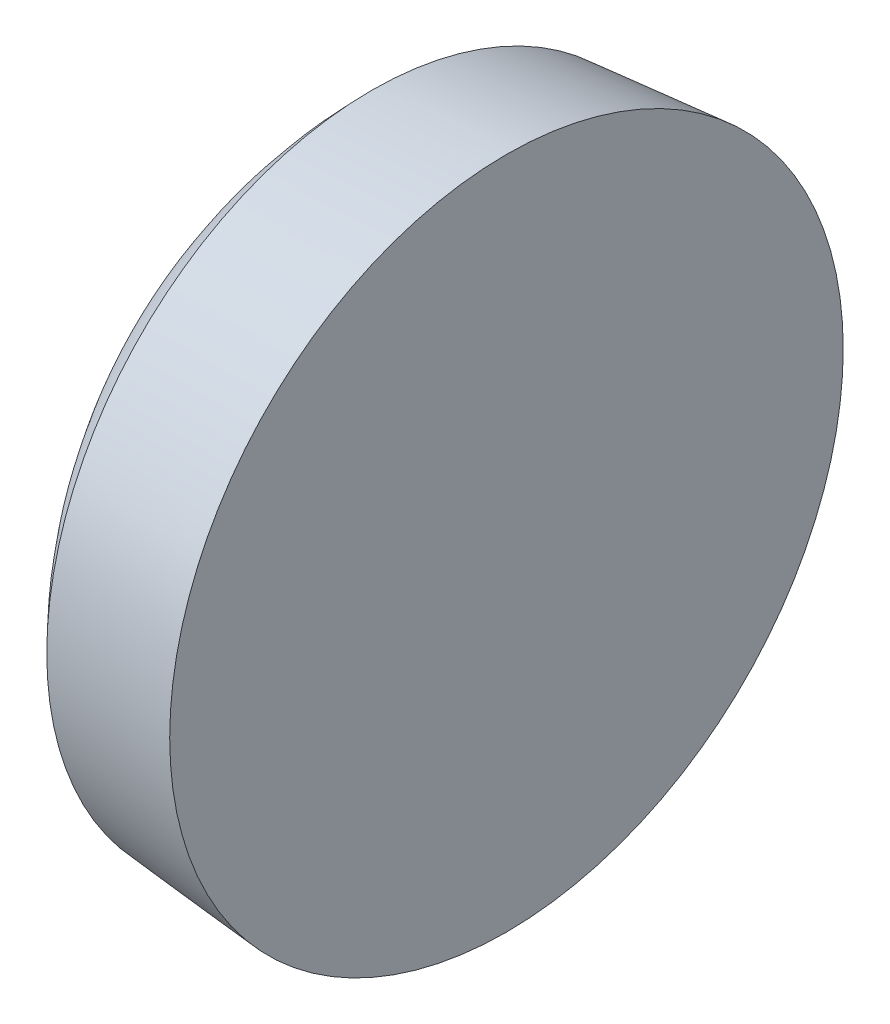
ISO-10303-21;
HEADER;
FILE_DESCRIPTION(('STEP AP214'),'2;1');
FILE_NAME('part.step','',(''),(''),'','','');
FILE_SCHEMA(('AUTOMOTIVE_DESIGN { 1 0 10303 214 1 1 1 1 }'));
ENDSEC;
DATA;
#1=APPLICATION_CONTEXT('core data for automotive mechanical design processes');
#2=APPLICATION_PROTOCOL_DEFINITION('international standard','automotive_design',2000,#1);
#3=PRODUCT_CONTEXT('',#1,'mechanical');
#4=PRODUCT('Part','Part','',(#3));
#5=PRODUCT_RELATED_PRODUCT_CATEGORY('part','',(#4));
#6=PRODUCT_DEFINITION_FORMATION('','',#4);
#7=PRODUCT_DEFINITION_CONTEXT('part definition',#1,'design');
#8=PRODUCT_DEFINITION('design','',#6,#7);
#9=PRODUCT_DEFINITION_SHAPE('','',#8);
#10=(LENGTH_UNIT() NAMED_UNIT(*) SI_UNIT(.MILLI.,.METRE.));
#11=(NAMED_UNIT(*) PLANE_ANGLE_UNIT() SI_UNIT($,.RADIAN.));
#12=(NAMED_UNIT(*) SI_UNIT($,.STERADIAN.) SOLID_ANGLE_UNIT());
#13=UNCERTAINTY_MEASURE_WITH_UNIT(LENGTH_MEASURE(1.E-05),#10,'distance_accuracy_value','');
#14=(GEOMETRIC_REPRESENTATION_CONTEXT(3) GLOBAL_UNCERTAINTY_ASSIGNED_CONTEXT((#13)) GLOBAL_UNIT_ASSIGNED_CONTEXT((#10,
#11,#12)) REPRESENTATION_CONTEXT('',''));
#15=CARTESIAN_POINT('',(0.,0.,0.));
#16=DIRECTION('',(0.,0.,1.));
#17=DIRECTION('',(1.,0.,0.));
#18=AXIS2_PLACEMENT_3D('',#15,#16,#17);
#19=CARTESIAN_POINT('',(176.066666666667,-6.9,10.));
#20=DIRECTION('',(-1.,0.,0.));
#21=DIRECTION('',(0.,0.,1.));
#22=AXIS2_PLACEMENT_3D('',#19,#20,#21);
#23=PLANE('',#22);
#24=DIRECTION('',(0.,0.,-1.));
#25=VECTOR('',#24,1.);
#26=CARTESIAN_POINT('',(176.066666666667,-5.95,10.));
#27=LINE('',#26,#25);
#28=CARTESIAN_POINT('',(176.066666666667,-5.95,9.82));
#29=VERTEX_POINT('',#28);
#30=CARTESIAN_POINT('',(176.066666666667,-5.95,10.18));
#31=VERTEX_POINT('',#30);
#32=EDGE_CURVE('E293',#29,#31,#27,.F.);
#33=ORIENTED_EDGE('',*,*,#32,.F.);
#34=DIRECTION('',(0.,1.,0.));
#35=VECTOR('',#34,1.);
#36=CARTESIAN_POINT('',(176.066666666667,-6.9,9.82));
#37=LINE('',#36,#35);
#38=CARTESIAN_POINT('',(176.066666666667,-6.72,9.82));
#39=VERTEX_POINT('',#38);
#40=EDGE_CURVE('E298',#39,#29,#37,.T.);
#41=ORIENTED_EDGE('',*,*,#40,.F.);
#42=DIRECTION('',(0.,0.,-1.));
#43=VECTOR('',#42,1.);
#44=CARTESIAN_POINT('',(176.066666666667,-6.72,10.));
#45=LINE('',#44,#43);
#46=CARTESIAN_POINT('',(176.066666666667,-6.72,9.05));
#47=VERTEX_POINT('',#46);
#48=EDGE_CURVE('E303',#47,#39,#45,.F.);
#49=ORIENTED_EDGE('',*,*,#48,.F.);
#50=DIRECTION('',(0.,1.,0.));
#51=VECTOR('',#50,1.);
#52=CARTESIAN_POINT('',(176.066666666667,-6.9,9.05));
#53=LINE('',#52,#51);
#54=CARTESIAN_POINT('',(176.066666666667,-7.08,9.05));
#55=VERTEX_POINT('',#54);
#56=EDGE_CURVE('E308',#55,#47,#53,.T.);
#57=ORIENTED_EDGE('',*,*,#56,.F.);
#58=DIRECTION('',(0.,0.,1.));
#59=VECTOR('',#58,1.);
#60=CARTESIAN_POINT('',(176.066666666667,-7.08,10.));
#61=LINE('',#60,#59);
#62=CARTESIAN_POINT('',(176.066666666667,-7.08,9.82));
#63=VERTEX_POINT('',#62);
#64=EDGE_CURVE('E313',#63,#55,#61,.F.);
#65=ORIENTED_EDGE('',*,*,#64,.F.);
#66=DIRECTION('',(0.,1.,0.));
#67=VECTOR('',#66,1.);
#68=CARTESIAN_POINT('',(176.066666666667,-6.9,9.82));
#69=LINE('',#68,#67);
#70=CARTESIAN_POINT('',(176.066666666667,-7.85,9.82));
#71=VERTEX_POINT('',#70);
#72=EDGE_CURVE('E318',#71,#63,#69,.T.);
#73=ORIENTED_EDGE('',*,*,#72,.F.);
#74=DIRECTION('',(0.,0.,-1.));
#75=VECTOR('',#74,1.);
#76=CARTESIAN_POINT('',(176.066666666667,-7.85,10.));
#77=LINE('',#76,#75);
#78=CARTESIAN_POINT('',(176.066666666667,-7.85,10.18));
#79=VERTEX_POINT('',#78);
#80=EDGE_CURVE('E267',#71,#79,#77,.F.);
#81=ORIENTED_EDGE('',*,*,#80,.T.);
#82=DIRECTION('',(0.,1.,0.));
#83=VECTOR('',#82,1.);
#84=CARTESIAN_POINT('',(176.066666666667,-6.9,10.18));
#85=LINE('',#84,#83);
#86=CARTESIAN_POINT('',(176.066666666667,-7.08,10.18));
#87=VERTEX_POINT('',#86);
#88=EDGE_CURVE('E264',#87,#79,#85,.F.);
#89=ORIENTED_EDGE('',*,*,#88,.F.);
#90=DIRECTION('',(0.,0.,1.));
#91=VECTOR('',#90,1.);
#92=CARTESIAN_POINT('',(176.066666666667,-7.08,10.));
#93=LINE('',#92,#91);
#94=CARTESIAN_POINT('',(176.066666666667,-7.08,10.95));
#95=VERTEX_POINT('',#94);
#96=EDGE_CURVE('E260',#95,#87,#93,.F.);
#97=ORIENTED_EDGE('',*,*,#96,.F.);
#98=DIRECTION('',(0.,1.,0.));
#99=VECTOR('',#98,1.);
#100=CARTESIAN_POINT('',(176.066666666667,-6.9,10.95));
#101=LINE('',#100,#99);
#102=CARTESIAN_POINT('',(176.066666666667,-6.72,10.95));
#103=VERTEX_POINT('',#102);
#104=EDGE_CURVE('E231',#95,#103,#101,.T.);
#105=ORIENTED_EDGE('',*,*,#104,.T.);
#106=DIRECTION('',(0.,0.,-1.));
#107=VECTOR('',#106,1.);
#108=CARTESIAN_POINT('',(176.066666666667,-6.72,10.));
#109=LINE('',#108,#107);
#110=CARTESIAN_POINT('',(176.066666666667,-6.72,10.18));
#111=VERTEX_POINT('',#110);
#112=EDGE_CURVE('E278',#111,#103,#109,.F.);
#113=ORIENTED_EDGE('',*,*,#112,.F.);
#114=DIRECTION('',(0.,1.,0.));
#115=VECTOR('',#114,1.);
#116=CARTESIAN_POINT('',(176.066666666667,-6.9,10.18));
#117=LINE('',#116,#115);
#118=EDGE_CURVE('E288',#31,#111,#117,.F.);
#119=ORIENTED_EDGE('',*,*,#118,.F.);
#120=EDGE_LOOP('',(#33,#41,#49,#57,#65,#73,#81,#89,#97,#105,#113,#119));
#121=FACE_BOUND('',#120,.T.);
#122=ADVANCED_FACE('F17',(#121),#23,.T.);
#123=CARTESIAN_POINT('',(175.466666666667,-7.08,10.));
#124=DIRECTION('',(0.,1.,0.));
#125=DIRECTION('',(0.,0.,1.));
#126=AXIS2_PLACEMENT_3D('',#123,#124,#125);
#127=PLANE('',#126);
#128=DIRECTION('',(1.,0.,0.));
#129=VECTOR('',#128,1.);
#130=CARTESIAN_POINT('',(175.466666666667,-7.08,10.95));
#131=LINE('',#130,#129);
#132=CARTESIAN_POINT('',(175.043762143476,-7.08,10.9500000000001));
#133=VERTEX_POINT('',#132);
#134=EDGE_CURVE('E89',#133,#95,#131,.T.);
#135=ORIENTED_EDGE('',*,*,#134,.T.);
#136=ORIENTED_EDGE('',*,*,#96,.T.);
#137=DIRECTION('',(-1.,0.,0.));
#138=VECTOR('',#137,1.);
#139=CARTESIAN_POINT('',(175.466666666667,-7.08,10.18));
#140=LINE('',#139,#138);
#141=CARTESIAN_POINT('',(174.878569096873,-7.08000000000002,10.18));
#142=VERTEX_POINT('',#141);
#143=EDGE_CURVE('E224',#142,#87,#140,.F.);
#144=ORIENTED_EDGE('',*,*,#143,.F.);
#145=CARTESIAN_POINT('',(175.043762143476,-7.08,10.9500000000001));
#146=CARTESIAN_POINT('',(175.032217129282,-7.08,10.9189995540507));
#147=CARTESIAN_POINT('',(175.021237746898,-7.08,10.8877884938069));
#148=CARTESIAN_POINT('',(175.00046454836,-7.08,10.825110453647));
#149=CARTESIAN_POINT('',(174.990666241349,-7.08,10.7936449620742));
#150=CARTESIAN_POINT('',(174.972242700709,-7.08,10.7304618501357));
#151=CARTESIAN_POINT('',(174.96361446108,-7.08,10.6987451062673));
#152=CARTESIAN_POINT('',(174.947522711913,-7.08,10.6350619663156));
#153=CARTESIAN_POINT('',(174.940057683091,-7.08,10.6030959541243));
#154=CARTESIAN_POINT('',(174.926288504705,-7.08,10.5389148788569));
#155=CARTESIAN_POINT('',(174.91998435514,-7.08,10.5066998157809));
#156=CARTESIAN_POINT('',(174.908537607774,-7.08,10.4420201537525));
#157=CARTESIAN_POINT('',(174.903396553029,-7.08,10.4095552817086));
#158=CARTESIAN_POINT('',(174.894281504356,-7.08,10.3443751591894));
#159=CARTESIAN_POINT('',(174.890310611427,-7.08,10.3116594750373));
#160=CARTESIAN_POINT('',(174.883545624518,-7.08,10.2459761632456));
#161=CARTESIAN_POINT('',(174.880756236699,-7.08,10.2130080508538));
#162=CARTESIAN_POINT('',(174.878569096873,-7.08,10.18));
#163=B_SPLINE_CURVE_WITH_KNOTS('',3,(#145,#146,#147,#148,#149,#150,#151,#152,#153,#154,#155,
#156,#157,#158,#159,#160,#161,#162),.UNSPECIFIED.,.F.,.F.,(4,2,2,2,2,2,2,2,4),(0.,
0.0992357442434378,0.198081387639297,0.296668072480536,0.39512489269415,0.493581712907767,
0.592168397749006,0.691014041144867,0.790249785388302),.UNSPECIFIED.);
#164=EDGE_CURVE('E20',#133,#142,#163,.T.);
#165=ORIENTED_EDGE('',*,*,#164,.F.);
#166=EDGE_LOOP('',(#135,#136,#144,#165));
#167=FACE_BOUND('',#166,.T.);
#168=ADVANCED_FACE('F221',(#167),#127,.T.);
#169=CARTESIAN_POINT('',(175.466666666667,-6.9,10.18));
#170=DIRECTION('',(0.,0.,-1.));
#171=DIRECTION('',(-1.,0.,0.));
#172=AXIS2_PLACEMENT_3D('',#169,#170,#171);
#173=PLANE('',#172);
#174=ORIENTED_EDGE('',*,*,#88,.T.);
#175=DIRECTION('',(1.,0.,0.));
#176=VECTOR('',#175,1.);
#177=CARTESIAN_POINT('',(175.466666666667,-7.85,10.18));
#178=LINE('',#177,#176);
#179=CARTESIAN_POINT('',(175.043762143476,-7.85,10.18));
#180=VERTEX_POINT('',#179);
#181=EDGE_CURVE('E324',#79,#180,#178,.F.);
#182=ORIENTED_EDGE('',*,*,#181,.T.);
#183=CARTESIAN_POINT('',(174.878569096873,-7.08000000000003,10.18));
#184=CARTESIAN_POINT('',(174.884223275561,-7.16559008255585,10.18));
#185=CARTESIAN_POINT('',(174.893954762962,-7.25090347737772,10.18));
#186=CARTESIAN_POINT('',(174.921321880478,-7.41965906159773,10.18));
#187=CARTESIAN_POINT('',(174.938903434517,-7.50311001948201,10.18));
#188=CARTESIAN_POINT('',(174.983632564079,-7.67504249159054,10.18));
#189=CARTESIAN_POINT('',(175.011468627175,-7.76334531100356,10.18));
#190=CARTESIAN_POINT('',(175.043762143476,-7.85000000000013,10.18));
#191=B_SPLINE_CURVE_WITH_KNOTS('',3,(#183,#184,#185,#186,#187,#188,#189,#190),.UNSPECIFIED.,.F.,
.F.,(4,2,2,4),(0.,0.257221658829358,0.512698117737389,0.78998348623172),.UNSPECIFIED.);
#192=EDGE_CURVE('E213',#142,#180,#191,.T.);
#193=ORIENTED_EDGE('',*,*,#192,.F.);
#194=ORIENTED_EDGE('',*,*,#143,.T.);
#195=EDGE_LOOP('',(#174,#182,#193,#194));
#196=FACE_BOUND('',#195,.T.);
#197=ADVANCED_FACE('F204',(#196),#173,.T.);
#198=CARTESIAN_POINT('',(175.466666666667,-7.85,10.));
#199=DIRECTION('',(0.,-1.,0.));
#200=DIRECTION('',(0.,0.,-1.));
#201=AXIS2_PLACEMENT_3D('',#198,#199,#200);
#202=PLANE('',#201);
#203=ORIENTED_EDGE('',*,*,#181,.F.);
#204=ORIENTED_EDGE('',*,*,#80,.F.);
#205=DIRECTION('',(1.,0.,0.));
#206=VECTOR('',#205,1.);
#207=CARTESIAN_POINT('',(175.466666666667,-7.85,9.82));
#208=LINE('',#207,#206);
#209=CARTESIAN_POINT('',(175.043762143476,-7.85000000000007,9.82));
#210=VERTEX_POINT('',#209);
#211=EDGE_CURVE('E320',#210,#71,#208,.T.);
#212=ORIENTED_EDGE('',*,*,#211,.F.);
#213=CARTESIAN_POINT('',(175.043762143476,-7.85,10.18));
#214=CARTESIAN_POINT('',(175.039533747777,-7.85000000000002,10.12));
#215=CARTESIAN_POINT('',(175.037419549928,-7.85000000000002,10.06));
#216=CARTESIAN_POINT('',(175.037419549928,-7.84999999999998,9.93999999999995));
#217=CARTESIAN_POINT('',(175.039533747777,-7.84999999999994,9.87999999999993));
#218=CARTESIAN_POINT('',(175.043762143476,-7.84999999999989,9.81999999999991));
#219=B_SPLINE_CURVE_WITH_KNOTS('',3,(#213,#214,#215,#216,#217,#218),.UNSPECIFIED.,.F.,.F.,(4,2,
4),(0.,0.180111711148747,0.360223422297494),.UNSPECIFIED.);
#220=EDGE_CURVE('E207',#180,#210,#219,.T.);
#221=ORIENTED_EDGE('',*,*,#220,.F.);
#222=EDGE_LOOP('',(#203,#204,#212,#221));
#223=FACE_BOUND('',#222,.T.);
#224=ADVANCED_FACE('F199',(#223),#202,.F.);
#225=CARTESIAN_POINT('',(175.466666666667,-6.9,9.82));
#226=DIRECTION('',(0.,0.,1.));
#227=DIRECTION('',(1.,0.,0.));
#228=AXIS2_PLACEMENT_3D('',#225,#226,#227);
#229=PLANE('',#228);
#230=ORIENTED_EDGE('',*,*,#72,.T.);
#231=DIRECTION('',(1.,0.,0.));
#232=VECTOR('',#231,1.);
#233=CARTESIAN_POINT('',(175.466666666667,-7.08,9.82));
#234=LINE('',#233,#232);
#235=CARTESIAN_POINT('',(174.878569096873,-7.08,9.81999999999998));
#236=VERTEX_POINT('',#235);
#237=EDGE_CURVE('E315',#236,#63,#234,.T.);
#238=ORIENTED_EDGE('',*,*,#237,.F.);
#239=CARTESIAN_POINT('',(175.043762143476,-7.85000000000013,9.82));
#240=CARTESIAN_POINT('',(175.032217129282,-7.81899955405071,9.82));
#241=CARTESIAN_POINT('',(175.021237746898,-7.78778849380685,9.82));
#242=CARTESIAN_POINT('',(175.00046454836,-7.72511045364696,9.82));
#243=CARTESIAN_POINT('',(174.990666241349,-7.69364496207416,9.82));
#244=CARTESIAN_POINT('',(174.972242700709,-7.6304618501357,9.82));
#245=CARTESIAN_POINT('',(174.96361446108,-7.59874510626734,9.82));
#246=CARTESIAN_POINT('',(174.947522711913,-7.53506196631559,9.82));
#247=CARTESIAN_POINT('',(174.940057683091,-7.50309595412427,9.82));
#248=CARTESIAN_POINT('',(174.926288504705,-7.43891487885691,9.82));
#249=CARTESIAN_POINT('',(174.91998435514,-7.40669981578087,9.82));
#250=CARTESIAN_POINT('',(174.908537607774,-7.34202015375246,9.82));
#251=CARTESIAN_POINT('',(174.903396553029,-7.30955528170863,9.82));
#252=CARTESIAN_POINT('',(174.894281504356,-7.24437515918937,9.82));
#253=CARTESIAN_POINT('',(174.890310611427,-7.21165947503728,9.82));
#254=CARTESIAN_POINT('',(174.883545624518,-7.14597616324565,9.82));
#255=CARTESIAN_POINT('',(174.880756236699,-7.11300805085382,9.82));
#256=CARTESIAN_POINT('',(174.878569096873,-7.08000000000003,9.82));
#257=B_SPLINE_CURVE_WITH_KNOTS('',3,(#239,#240,#241,#242,#243,#244,#245,#246,#247,#248,#249,
#250,#251,#252,#253,#254,#255,#256),.UNSPECIFIED.,.F.,.F.,(4,2,2,2,2,2,2,2,4),(0.,
0.0992357442434378,0.198081387639298,0.296668072480536,0.39512489269415,0.493581712907767,
0.592168397749009,0.691014041144869,0.790249785388304),.UNSPECIFIED.);
#258=EDGE_CURVE('E184',#210,#236,#257,.T.);
#259=ORIENTED_EDGE('',*,*,#258,.F.);
#260=ORIENTED_EDGE('',*,*,#211,.T.);
#261=EDGE_LOOP('',(#230,#238,#259,#260));
#262=FACE_BOUND('',#261,.T.);
#263=ADVANCED_FACE('F194',(#262),#229,.T.);
#264=CARTESIAN_POINT('',(175.466666666667,-7.08,10.));
#265=DIRECTION('',(0.,1.,0.));
#266=DIRECTION('',(0.,0.,1.));
#267=AXIS2_PLACEMENT_3D('',#264,#265,#266);
#268=PLANE('',#267);
#269=DIRECTION('',(1.,0.,0.));
#270=VECTOR('',#269,1.);
#271=CARTESIAN_POINT('',(175.466666666667,-7.08,9.05));
#272=LINE('',#271,#270);
#273=CARTESIAN_POINT('',(175.043762143476,-7.08,9.05));
#274=VERTEX_POINT('',#273);
#275=EDGE_CURVE('E310',#274,#55,#272,.T.);
#276=ORIENTED_EDGE('',*,*,#275,.F.);
#277=CARTESIAN_POINT('',(174.878569096873,-7.08,9.81999999999997));
#278=CARTESIAN_POINT('',(174.884223275561,-7.08,9.73440991744415));
#279=CARTESIAN_POINT('',(174.893954762962,-7.08,9.64909652262228));
#280=CARTESIAN_POINT('',(174.921321880478,-7.08,9.48034093840227));
#281=CARTESIAN_POINT('',(174.938903434517,-7.08,9.39688998051799));
#282=CARTESIAN_POINT('',(174.983632564079,-7.08,9.22495750840946));
#283=CARTESIAN_POINT('',(175.011468627175,-7.08,9.13665468899644));
#284=CARTESIAN_POINT('',(175.043762143476,-7.08,9.04999999999987));
#285=B_SPLINE_CURVE_WITH_KNOTS('',3,(#277,#278,#279,#280,#281,#282,#283,#284),.UNSPECIFIED.,.F.,
.F.,(4,2,2,4),(0.,0.257221658829358,0.512698117737392,0.789983486231717),.UNSPECIFIED.);
#286=EDGE_CURVE('E176',#236,#274,#285,.T.);
#287=ORIENTED_EDGE('',*,*,#286,.F.);
#288=ORIENTED_EDGE('',*,*,#237,.T.);
#289=ORIENTED_EDGE('',*,*,#64,.T.);
#290=EDGE_LOOP('',(#276,#287,#288,#289));
#291=FACE_BOUND('',#290,.T.);
#292=ADVANCED_FACE('F191',(#291),#268,.T.);
#293=CARTESIAN_POINT('',(175.466666666667,-6.9,9.05));
#294=DIRECTION('',(0.,0.,1.));
#295=DIRECTION('',(1.,0.,0.));
#296=AXIS2_PLACEMENT_3D('',#293,#294,#295);
#297=PLANE('',#296);
#298=DIRECTION('',(1.,0.,0.));
#299=VECTOR('',#298,1.);
#300=CARTESIAN_POINT('',(175.466666666667,-6.72,9.05));
#301=LINE('',#300,#299);
#302=CARTESIAN_POINT('',(175.043762143476,-6.72,9.04999999999994));
#303=VERTEX_POINT('',#302);
#304=EDGE_CURVE('E305',#303,#47,#301,.T.);
#305=ORIENTED_EDGE('',*,*,#304,.F.);
#306=CARTESIAN_POINT('',(175.043762143476,-6.72,9.05));
#307=CARTESIAN_POINT('',(175.037419549928,-6.80988825418797,9.05));
#308=CARTESIAN_POINT('',(175.037419549928,-6.9,9.05));
#309=B_SPLINE_CURVE_WITH_KNOTS('',2,(#306,#307,#308),.UNSPECIFIED.,.F.,.F.,(3,3),(0.,1.),.UNSPECIFIED.);
#310=CARTESIAN_POINT('',(175.037419549928,-6.9,9.05));
#311=VERTEX_POINT('',#310);
#312=EDGE_CURVE('E175',#311,#303,#309,.F.);
#313=ORIENTED_EDGE('',*,*,#312,.F.);
#314=CARTESIAN_POINT('',(175.037419549928,-6.9,9.05));
#315=CARTESIAN_POINT('',(175.037419549928,-6.99011174581202,9.05));
#316=CARTESIAN_POINT('',(175.043762143476,-7.08,9.05));
#317=B_SPLINE_CURVE_WITH_KNOTS('',2,(#314,#315,#316),.UNSPECIFIED.,.F.,.F.,(3,3),(0.,1.),.UNSPECIFIED.);
#318=EDGE_CURVE('E183',#274,#311,#317,.F.);
#319=ORIENTED_EDGE('',*,*,#318,.F.);
#320=ORIENTED_EDGE('',*,*,#275,.T.);
#321=ORIENTED_EDGE('',*,*,#56,.T.);
#322=EDGE_LOOP('',(#305,#313,#319,#320,#321));
#323=FACE_BOUND('',#322,.T.);
#324=ADVANCED_FACE('F164',(#323),#297,.T.);
#325=CARTESIAN_POINT('',(175.466666666667,-6.72,10.));
#326=DIRECTION('',(0.,-1.,0.));
#327=DIRECTION('',(0.,0.,-1.));
#328=AXIS2_PLACEMENT_3D('',#325,#326,#327);
#329=PLANE('',#328);
#330=ORIENTED_EDGE('',*,*,#304,.T.);
#331=ORIENTED_EDGE('',*,*,#48,.T.);
#332=DIRECTION('',(1.,0.,0.));
#333=VECTOR('',#332,1.);
#334=CARTESIAN_POINT('',(175.466666666667,-6.72,9.82));
#335=LINE('',#334,#333);
#336=CARTESIAN_POINT('',(174.878569096873,-6.71999999999999,9.82));
#337=VERTEX_POINT('',#336);
#338=EDGE_CURVE('E300',#337,#39,#335,.T.);
#339=ORIENTED_EDGE('',*,*,#338,.F.);
#340=CARTESIAN_POINT('',(175.043762143476,-6.72,9.04999999999987));
#341=CARTESIAN_POINT('',(175.032217129282,-6.72,9.08100044594929));
#342=CARTESIAN_POINT('',(175.021237746898,-6.72,9.11221150619315));
#343=CARTESIAN_POINT('',(175.00046454836,-6.72,9.17488954635304));
#344=CARTESIAN_POINT('',(174.990666241349,-6.72,9.20635503792584));
#345=CARTESIAN_POINT('',(174.972242700709,-6.72,9.2695381498643));
#346=CARTESIAN_POINT('',(174.96361446108,-6.72,9.30125489373266));
#347=CARTESIAN_POINT('',(174.947522711913,-6.72,9.36493803368441));
#348=CARTESIAN_POINT('',(174.940057683091,-6.72,9.39690404587573));
#349=CARTESIAN_POINT('',(174.926288504705,-6.72,9.46108512114309));
#350=CARTESIAN_POINT('',(174.91998435514,-6.72,9.49330018421913));
#351=CARTESIAN_POINT('',(174.908537607774,-6.72,9.55797984624755));
#352=CARTESIAN_POINT('',(174.903396553029,-6.72,9.59044471829137));
#353=CARTESIAN_POINT('',(174.894281504356,-6.72,9.65562484081063));
#354=CARTESIAN_POINT('',(174.890310611427,-6.72,9.68834052496272));
#355=CARTESIAN_POINT('',(174.883545624518,-6.72,9.75402383675435));
#356=CARTESIAN_POINT('',(174.880756236699,-6.72,9.78699194914618));
#357=CARTESIAN_POINT('',(174.878569096873,-6.72,9.81999999999997));
#358=B_SPLINE_CURVE_WITH_KNOTS('',3,(#340,#341,#342,#343,#344,#345,#346,#347,#348,#349,#350,
#351,#352,#353,#354,#355,#356,#357),.UNSPECIFIED.,.F.,.F.,(4,2,2,2,2,2,2,2,4),(0.,
0.0992357442434378,0.198081387639297,0.296668072480536,0.39512489269415,0.493581712907769,
0.592168397749008,0.69101404114487,0.790249785388303),.UNSPECIFIED.);
#359=EDGE_CURVE('E168',#303,#337,#358,.T.);
#360=ORIENTED_EDGE('',*,*,#359,.F.);
#361=EDGE_LOOP('',(#330,#331,#339,#360));
#362=FACE_BOUND('',#361,.T.);
#363=ADVANCED_FACE('F159',(#362),#329,.T.);
#364=CARTESIAN_POINT('',(175.466666666667,-6.9,9.82));
#365=DIRECTION('',(0.,0.,1.));
#366=DIRECTION('',(1.,0.,0.));
#367=AXIS2_PLACEMENT_3D('',#364,#365,#366);
#368=PLANE('',#367);
#369=ORIENTED_EDGE('',*,*,#40,.T.);
#370=DIRECTION('',(1.,0.,0.));
#371=VECTOR('',#370,1.);
#372=CARTESIAN_POINT('',(175.466666666667,-5.95,9.82));
#373=LINE('',#372,#371);
#374=CARTESIAN_POINT('',(175.043762143476,-5.95,9.81999999999999));
#375=VERTEX_POINT('',#374);
#376=EDGE_CURVE('E295',#375,#29,#373,.T.);
#377=ORIENTED_EDGE('',*,*,#376,.F.);
#378=CARTESIAN_POINT('',(174.878569096873,-6.71999999999997,9.82));
#379=CARTESIAN_POINT('',(174.884223275561,-6.63440991744415,9.82));
#380=CARTESIAN_POINT('',(174.893954762962,-6.54909652262227,9.82));
#381=CARTESIAN_POINT('',(174.921321880478,-6.38034093840227,9.82));
#382=CARTESIAN_POINT('',(174.938903434517,-6.29688998051799,9.82));
#383=CARTESIAN_POINT('',(174.983632564079,-6.12495750840946,9.82));
#384=CARTESIAN_POINT('',(175.011468627175,-6.03665468899643,9.82));
#385=CARTESIAN_POINT('',(175.043762143476,-5.94999999999987,9.82));
#386=B_SPLINE_CURVE_WITH_KNOTS('',3,(#378,#379,#380,#381,#382,#383,#384,#385),.UNSPECIFIED.,.F.,
.F.,(4,2,2,4),(0.,0.25722165882936,0.512698117737392,0.789983486231722),.UNSPECIFIED.);
#387=EDGE_CURVE('E144',#337,#375,#386,.T.);
#388=ORIENTED_EDGE('',*,*,#387,.F.);
#389=ORIENTED_EDGE('',*,*,#338,.T.);
#390=EDGE_LOOP('',(#369,#377,#388,#389));
#391=FACE_BOUND('',#390,.T.);
#392=ADVANCED_FACE('F154',(#391),#368,.T.);
#393=CARTESIAN_POINT('',(175.466666666667,-5.95,10.));
#394=DIRECTION('',(0.,-1.,0.));
#395=DIRECTION('',(0.,0.,-1.));
#396=AXIS2_PLACEMENT_3D('',#393,#394,#395);
#397=PLANE('',#396);
#398=ORIENTED_EDGE('',*,*,#32,.T.);
#399=DIRECTION('',(-1.,0.,0.));
#400=VECTOR('',#399,1.);
#401=CARTESIAN_POINT('',(175.466666666667,-5.95,10.18));
#402=LINE('',#401,#400);
#403=CARTESIAN_POINT('',(175.043762143476,-5.94999999999994,10.18));
#404=VERTEX_POINT('',#403);
#405=EDGE_CURVE('E290',#404,#31,#402,.F.);
#406=ORIENTED_EDGE('',*,*,#405,.F.);
#407=CARTESIAN_POINT('',(175.043762143476,-5.95,9.81999999999997));
#408=CARTESIAN_POINT('',(175.039533747777,-5.94999999999999,9.87999999999999));
#409=CARTESIAN_POINT('',(175.037419549928,-5.94999999999999,9.94000000000001));
#410=CARTESIAN_POINT('',(175.037419549928,-5.95000000000001,10.0600000000001));
#411=CARTESIAN_POINT('',(175.039533747777,-5.95000000000003,10.1200000000001));
#412=CARTESIAN_POINT('',(175.043762143476,-5.95000000000006,10.1800000000001));
#413=B_SPLINE_CURVE_WITH_KNOTS('',3,(#407,#408,#409,#410,#411,#412),.UNSPECIFIED.,.F.,.F.,(4,2,
4),(0.,0.180111711148747,0.360223422297492),.UNSPECIFIED.);
#414=EDGE_CURVE('E137',#375,#404,#413,.T.);
#415=ORIENTED_EDGE('',*,*,#414,.F.);
#416=ORIENTED_EDGE('',*,*,#376,.T.);
#417=EDGE_LOOP('',(#398,#406,#415,#416));
#418=FACE_BOUND('',#417,.T.);
#419=ADVANCED_FACE('F151',(#418),#397,.T.);
#420=CARTESIAN_POINT('',(175.466666666667,-6.9,10.18));
#421=DIRECTION('',(0.,0.,-1.));
#422=DIRECTION('',(-1.,0.,0.));
#423=AXIS2_PLACEMENT_3D('',#420,#421,#422);
#424=PLANE('',#423);
#425=ORIENTED_EDGE('',*,*,#118,.T.);
#426=DIRECTION('',(1.,0.,0.));
#427=VECTOR('',#426,1.);
#428=CARTESIAN_POINT('',(175.466666666667,-6.72,10.18));
#429=LINE('',#428,#427);
#430=CARTESIAN_POINT('',(174.878569096873,-6.72,10.18));
#431=VERTEX_POINT('',#430);
#432=EDGE_CURVE('E280',#431,#111,#429,.T.);
#433=ORIENTED_EDGE('',*,*,#432,.F.);
#434=CARTESIAN_POINT('',(175.043762143476,-5.94999999999987,10.18));
#435=CARTESIAN_POINT('',(175.032217129282,-5.98100044594929,10.18));
#436=CARTESIAN_POINT('',(175.021237746898,-6.01221150619315,10.18));
#437=CARTESIAN_POINT('',(175.00046454836,-6.07488954635304,10.18));
#438=CARTESIAN_POINT('',(174.990666241349,-6.10635503792584,10.18));
#439=CARTESIAN_POINT('',(174.972242700709,-6.1695381498643,10.18));
#440=CARTESIAN_POINT('',(174.96361446108,-6.20125489373266,10.18));
#441=CARTESIAN_POINT('',(174.947522711913,-6.26493803368441,10.18));
#442=CARTESIAN_POINT('',(174.940057683091,-6.29690404587573,10.18));
#443=CARTESIAN_POINT('',(174.926288504705,-6.36108512114309,10.18));
#444=CARTESIAN_POINT('',(174.91998435514,-6.39330018421913,10.18));
#445=CARTESIAN_POINT('',(174.908537607774,-6.45797984624754,10.18));
#446=CARTESIAN_POINT('',(174.903396553029,-6.49044471829137,10.18));
#447=CARTESIAN_POINT('',(174.894281504356,-6.55562484081063,10.18));
#448=CARTESIAN_POINT('',(174.890310611427,-6.58834052496272,10.18));
#449=CARTESIAN_POINT('',(174.883545624518,-6.65402383675435,10.18));
#450=CARTESIAN_POINT('',(174.880756236699,-6.68699194914618,10.18));
#451=CARTESIAN_POINT('',(174.878569096873,-6.71999999999997,10.18));
#452=B_SPLINE_CURVE_WITH_KNOTS('',3,(#434,#435,#436,#437,#438,#439,#440,#441,#442,#443,#444,
#445,#446,#447,#448,#449,#450,#451),.UNSPECIFIED.,.F.,.F.,(4,2,2,2,2,2,2,2,4),(0.,
0.0992357442434378,0.198081387639299,0.296668072480536,0.39512489269415,0.493581712907767,
0.59216839774901,0.691014041144871,0.790249785388305),.UNSPECIFIED.);
#453=EDGE_CURVE('E100',#404,#431,#452,.T.);
#454=ORIENTED_EDGE('',*,*,#453,.F.);
#455=ORIENTED_EDGE('',*,*,#405,.T.);
#456=EDGE_LOOP('',(#425,#433,#454,#455));
#457=FACE_BOUND('',#456,.T.);
#458=ADVANCED_FACE('F123',(#457),#424,.T.);
#459=CARTESIAN_POINT('',(175.466666666667,-6.72,10.));
#460=DIRECTION('',(0.,-1.,0.));
#461=DIRECTION('',(0.,0.,-1.));
#462=AXIS2_PLACEMENT_3D('',#459,#460,#461);
#463=PLANE('',#462);
#464=DIRECTION('',(1.,0.,0.));
#465=VECTOR('',#464,1.);
#466=CARTESIAN_POINT('',(175.466666666667,-6.72,10.95));
#467=LINE('',#466,#465);
#468=CARTESIAN_POINT('',(175.043762143476,-6.72,10.95));
#469=VERTEX_POINT('',#468);
#470=EDGE_CURVE('E40',#103,#469,#467,.F.);
#471=ORIENTED_EDGE('',*,*,#470,.T.);
#472=CARTESIAN_POINT('',(174.878569096873,-6.72,10.18));
#473=CARTESIAN_POINT('',(174.884223275561,-6.72,10.2655900825558));
#474=CARTESIAN_POINT('',(174.893954762962,-6.72,10.3509034773777));
#475=CARTESIAN_POINT('',(174.921321880478,-6.72,10.5196590615977));
#476=CARTESIAN_POINT('',(174.938903434517,-6.72,10.603110019482));
#477=CARTESIAN_POINT('',(174.983632564079,-6.72,10.7750424915905));
#478=CARTESIAN_POINT('',(175.011468627175,-6.72,10.8633453110036));
#479=CARTESIAN_POINT('',(175.043762143476,-6.72,10.9500000000001));
#480=B_SPLINE_CURVE_WITH_KNOTS('',3,(#472,#473,#474,#475,#476,#477,#478,#479),.UNSPECIFIED.,.F.,
.F.,(4,2,2,4),(0.,0.257221658829358,0.512698117737392,0.789983486231717),.UNSPECIFIED.);
#481=EDGE_CURVE('E96',#431,#469,#480,.T.);
#482=ORIENTED_EDGE('',*,*,#481,.F.);
#483=ORIENTED_EDGE('',*,*,#432,.T.);
#484=ORIENTED_EDGE('',*,*,#112,.T.);
#485=EDGE_LOOP('',(#471,#482,#483,#484));
#486=FACE_BOUND('',#485,.T.);
#487=ADVANCED_FACE('F115',(#486),#463,.T.);
#488=CARTESIAN_POINT('',(175.466666666667,-6.9,10.95));
#489=DIRECTION('',(0.,0.,1.));
#490=DIRECTION('',(1.,0.,0.));
#491=AXIS2_PLACEMENT_3D('',#488,#489,#490);
#492=PLANE('',#491);
#493=ORIENTED_EDGE('',*,*,#470,.F.);
#494=ORIENTED_EDGE('',*,*,#104,.F.);
#495=ORIENTED_EDGE('',*,*,#134,.F.);
#496=CARTESIAN_POINT('',(175.037419549928,-6.9,10.95));
#497=CARTESIAN_POINT('',(175.037419549928,-6.99011174581202,10.95));
#498=CARTESIAN_POINT('',(175.043762143476,-7.08,10.95));
#499=B_SPLINE_CURVE_WITH_KNOTS('',2,(#496,#497,#498),.UNSPECIFIED.,.F.,.F.,(3,3),(0.,1.),.UNSPECIFIED.);
#500=CARTESIAN_POINT('',(175.037419549928,-6.9,10.95));
#501=VERTEX_POINT('',#500);
#502=EDGE_CURVE('E82',#501,#133,#499,.T.);
#503=ORIENTED_EDGE('',*,*,#502,.F.);
#504=CARTESIAN_POINT('',(175.043762143476,-6.72,10.95));
#505=CARTESIAN_POINT('',(175.037419549928,-6.80988825418797,10.95));
#506=CARTESIAN_POINT('',(175.037419549928,-6.9,10.95));
#507=B_SPLINE_CURVE_WITH_KNOTS('',2,(#504,#505,#506),.UNSPECIFIED.,.F.,.F.,(3,3),(0.,1.),.UNSPECIFIED.);
#508=EDGE_CURVE('E85',#469,#501,#507,.T.);
#509=ORIENTED_EDGE('',*,*,#508,.F.);
#510=EDGE_LOOP('',(#493,#494,#495,#503,#509));
#511=FACE_BOUND('',#510,.T.);
#512=ADVANCED_FACE('F84',(#511),#492,.F.);
#513=CARTESIAN_POINT('',(177.594751046113,-6.9,10.));
#514=DIRECTION('',(1.,0.,0.));
#515=DIRECTION('',(0.,1.,0.));
#516=AXIS2_PLACEMENT_3D('',#513,#514,#515);
#517=SPHERICAL_SURFACE('',#516,2.72808437944638);
#518=CARTESIAN_POINT('',(175.666666666643,-6.9,10.));
#519=DIRECTION('',(1.,0.,0.));
#520=DIRECTION('',(0.,0.,1.));
#521=AXIS2_PLACEMENT_3D('',#518,#519,#520);
#522=CIRCLE('',#521,1.93000906918229);
#523=CARTESIAN_POINT('',(175.666666666643,-6.89999999999993,11.9300090691823));
#524=VERTEX_POINT('',#523);
#525=EDGE_CURVE('E31',#524,#524,#522,.T.);
#526=ORIENTED_EDGE('',*,*,#525,.F.);
#527=EDGE_LOOP('',(#526));
#528=FACE_BOUND('',#527,.T.);
#529=ORIENTED_EDGE('',*,*,#481,.T.);
#530=ORIENTED_EDGE('',*,*,#508,.T.);
#531=ORIENTED_EDGE('',*,*,#502,.T.);
#532=ORIENTED_EDGE('',*,*,#164,.T.);
#533=ORIENTED_EDGE('',*,*,#192,.T.);
#534=ORIENTED_EDGE('',*,*,#220,.T.);
#535=ORIENTED_EDGE('',*,*,#258,.T.);
#536=ORIENTED_EDGE('',*,*,#286,.T.);
#537=ORIENTED_EDGE('',*,*,#318,.T.);
#538=ORIENTED_EDGE('',*,*,#312,.T.);
#539=ORIENTED_EDGE('',*,*,#359,.T.);
#540=ORIENTED_EDGE('',*,*,#387,.T.);
#541=ORIENTED_EDGE('',*,*,#414,.T.);
#542=ORIENTED_EDGE('',*,*,#453,.T.);
#543=EDGE_LOOP('',(#529,#530,#531,#532,#533,#534,#535,#536,#537,#538,#539,#540,#541,#542));
#544=FACE_BOUND('',#543,.T.);
#545=ADVANCED_FACE('F94',(#528,#544),#517,.T.);
#546=CARTESIAN_POINT('',(176.46666666667,-6.9,10.));
#547=DIRECTION('',(1.,0.,0.));
#548=DIRECTION('',(0.,0.,-1.));
#549=AXIS2_PLACEMENT_3D('',#546,#547,#548);
#550=CONICAL_SURFACE('',#549,2.00000000000045,0.0872664625936403);
#551=CARTESIAN_POINT('',(176.46666666667,-6.9,10.));
#552=DIRECTION('',(1.,0.,0.));
#553=DIRECTION('',(0.,0.,-1.));
#554=AXIS2_PLACEMENT_3D('',#551,#552,#553);
#555=CIRCLE('',#554,2.00000000000045);
#556=CARTESIAN_POINT('',(176.46666666667,-6.9,7.99999999999955));
#557=VERTEX_POINT('',#556);
#558=EDGE_CURVE('E11',#557,#557,#555,.T.);
#559=ORIENTED_EDGE('',*,*,#558,.F.);
#560=EDGE_LOOP('',(#559));
#561=FACE_BOUND('',#560,.T.);
#562=ORIENTED_EDGE('',*,*,#525,.T.);
#563=EDGE_LOOP('',(#562));
#564=FACE_BOUND('',#563,.T.);
#565=ADVANCED_FACE('F402',(#561,#564),#550,.T.);
#566=CARTESIAN_POINT('',(176.466666666667,-6.9,11.));
#567=DIRECTION('',(1.,0.,0.));
#568=DIRECTION('',(0.,0.,-1.));
#569=AXIS2_PLACEMENT_3D('',#566,#567,#568);
#570=PLANE('',#569);
#571=ORIENTED_EDGE('',*,*,#558,.T.);
#572=EDGE_LOOP('',(#571));
#573=FACE_BOUND('',#572,.T.);
#574=ADVANCED_FACE('F400',(#573),#570,.T.);
#575=CLOSED_SHELL('',(#122,#168,#197,#224,#263,#292,#324,#363,#392,#419,#458,#487,#512,#545,
#565,#574));
#576=MANIFOLD_SOLID_BREP('B1',#575);
#577=ADVANCED_BREP_SHAPE_REPRESENTATION('',(#18,#576),#14);
#578=SHAPE_DEFINITION_REPRESENTATION(#9,#577);
ENDSEC;
END-ISO-10303-21;
